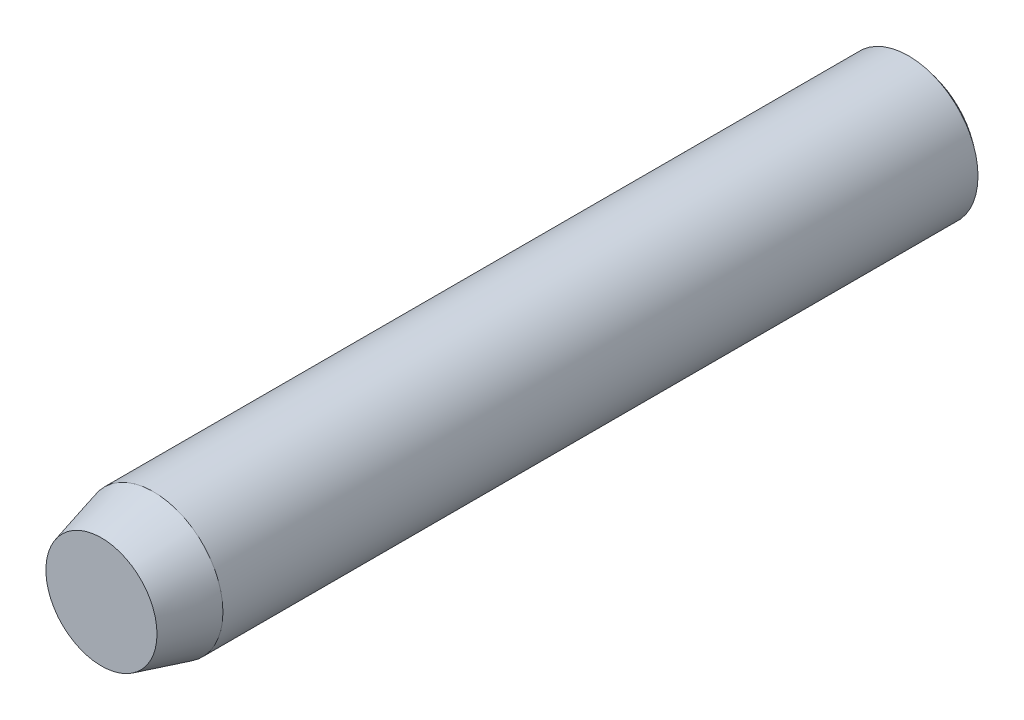
ISO-10303-21;
HEADER;
FILE_DESCRIPTION(('STEP AP214'),'2;1');
FILE_NAME('part.step','',(''),(''),'','','');
FILE_SCHEMA(('AUTOMOTIVE_DESIGN { 1 0 10303 214 1 1 1 1 }'));
ENDSEC;
DATA;
#1=APPLICATION_CONTEXT('core data for automotive mechanical design processes');
#2=APPLICATION_PROTOCOL_DEFINITION('international standard','automotive_design',2000,#1);
#3=PRODUCT_CONTEXT('',#1,'mechanical');
#4=PRODUCT('Part','Part','',(#3));
#5=PRODUCT_RELATED_PRODUCT_CATEGORY('part','',(#4));
#6=PRODUCT_DEFINITION_FORMATION('','',#4);
#7=PRODUCT_DEFINITION_CONTEXT('part definition',#1,'design');
#8=PRODUCT_DEFINITION('design','',#6,#7);
#9=PRODUCT_DEFINITION_SHAPE('','',#8);
#10=(LENGTH_UNIT() NAMED_UNIT(*) SI_UNIT(.MILLI.,.METRE.));
#11=(NAMED_UNIT(*) PLANE_ANGLE_UNIT() SI_UNIT($,.RADIAN.));
#12=(NAMED_UNIT(*) SI_UNIT($,.STERADIAN.) SOLID_ANGLE_UNIT());
#13=UNCERTAINTY_MEASURE_WITH_UNIT(LENGTH_MEASURE(1.E-05),#10,'distance_accuracy_value','');
#14=(GEOMETRIC_REPRESENTATION_CONTEXT(3) GLOBAL_UNCERTAINTY_ASSIGNED_CONTEXT((#13)) GLOBAL_UNIT_ASSIGNED_CONTEXT((#10,
#11,#12)) REPRESENTATION_CONTEXT('',''));
#15=CARTESIAN_POINT('',(0.,0.,0.));
#16=DIRECTION('',(0.,0.,1.));
#17=DIRECTION('',(1.,0.,0.));
#18=AXIS2_PLACEMENT_3D('',#15,#16,#17);
#19=CARTESIAN_POINT('',(0.,0.,24.));
#20=DIRECTION('',(0.,0.,-1.));
#21=DIRECTION('',(-1.,0.,0.));
#22=AXIS2_PLACEMENT_3D('',#19,#20,#21);
#23=CYLINDRICAL_SURFACE('',#22,2.);
#24=CARTESIAN_POINT('',(0.,0.,22.5));
#25=DIRECTION('',(0.,0.,1.));
#26=DIRECTION('',(1.,0.,0.));
#27=AXIS2_PLACEMENT_3D('',#24,#25,#26);
#28=CIRCLE('',#27,2.);
#29=CARTESIAN_POINT('',(2.,0.,22.5));
#30=VERTEX_POINT('',#29);
#31=EDGE_CURVE('E11',#30,#30,#28,.F.);
#32=ORIENTED_EDGE('',*,*,#31,.T.);
#33=EDGE_LOOP('',(#32));
#34=FACE_BOUND('',#33,.T.);
#35=CARTESIAN_POINT('',(0.,0.,0.750000000000001));
#36=DIRECTION('',(0.,0.,1.));
#37=DIRECTION('',(1.,0.,0.));
#38=AXIS2_PLACEMENT_3D('',#35,#36,#37);
#39=CIRCLE('',#38,2.);
#40=CARTESIAN_POINT('',(2.,0.,0.750000000000001));
#41=VERTEX_POINT('',#40);
#42=EDGE_CURVE('E51',#41,#41,#39,.T.);
#43=ORIENTED_EDGE('',*,*,#42,.T.);
#44=EDGE_LOOP('',(#43));
#45=FACE_BOUND('',#44,.T.);
#46=ADVANCED_FACE('F34',(#34,#45),#23,.T.);
#47=CARTESIAN_POINT('',(0.,0.,24.));
#48=DIRECTION('',(0.,0.,1.));
#49=DIRECTION('',(1.,0.,0.));
#50=AXIS2_PLACEMENT_3D('',#47,#48,#49);
#51=PLANE('',#50);
#52=CARTESIAN_POINT('',(0.,0.,24.));
#53=DIRECTION('',(0.,0.,1.));
#54=DIRECTION('',(1.,0.,0.));
#55=AXIS2_PLACEMENT_3D('',#52,#53,#54);
#56=CIRCLE('',#55,1.6);
#57=CARTESIAN_POINT('',(1.6,0.,24.));
#58=VERTEX_POINT('',#57);
#59=EDGE_CURVE('E41',#58,#58,#56,.T.);
#60=ORIENTED_EDGE('',*,*,#59,.T.);
#61=EDGE_LOOP('',(#60));
#62=FACE_BOUND('',#61,.T.);
#63=ADVANCED_FACE('F47',(#62),#51,.T.);
#64=CARTESIAN_POINT('',(0.,0.,3.04166666666667));
#65=DIRECTION('',(0.,0.,1.));
#66=DIRECTION('',(-1.,0.,0.));
#67=AXIS2_PLACEMENT_3D('',#64,#65,#66);
#68=SPHERICAL_SURFACE('',#67,3.04166666666667);
#69=CARTESIAN_POINT('',(0.,0.,0.));
#70=VERTEX_POINT('',#69);
#71=VERTEX_LOOP('',#70);
#72=FACE_BOUND('',#71,.T.);
#73=ORIENTED_EDGE('',*,*,#42,.F.);
#74=EDGE_LOOP('',(#73));
#75=FACE_BOUND('',#74,.T.);
#76=ADVANCED_FACE('F44',(#72,#75),#68,.T.);
#77=CARTESIAN_POINT('',(0.,0.,24.));
#78=DIRECTION('',(0.,0.,-1.));
#79=DIRECTION('',(-1.,0.,0.));
#80=AXIS2_PLACEMENT_3D('',#77,#78,#79);
#81=CONICAL_SURFACE('',#80,1.6,0.260602391747337);
#82=ORIENTED_EDGE('',*,*,#31,.F.);
#83=EDGE_LOOP('',(#82));
#84=FACE_BOUND('',#83,.T.);
#85=ORIENTED_EDGE('',*,*,#59,.F.);
#86=EDGE_LOOP('',(#85));
#87=FACE_BOUND('',#86,.T.);
#88=ADVANCED_FACE('F36',(#84,#87),#81,.T.);
#89=CLOSED_SHELL('',(#46,#63,#76,#88));
#90=MANIFOLD_SOLID_BREP('B2',#89);
#91=ADVANCED_BREP_SHAPE_REPRESENTATION('',(#18,#90),#14);
#92=SHAPE_DEFINITION_REPRESENTATION(#9,#91);
ENDSEC;
END-ISO-10303-21;
